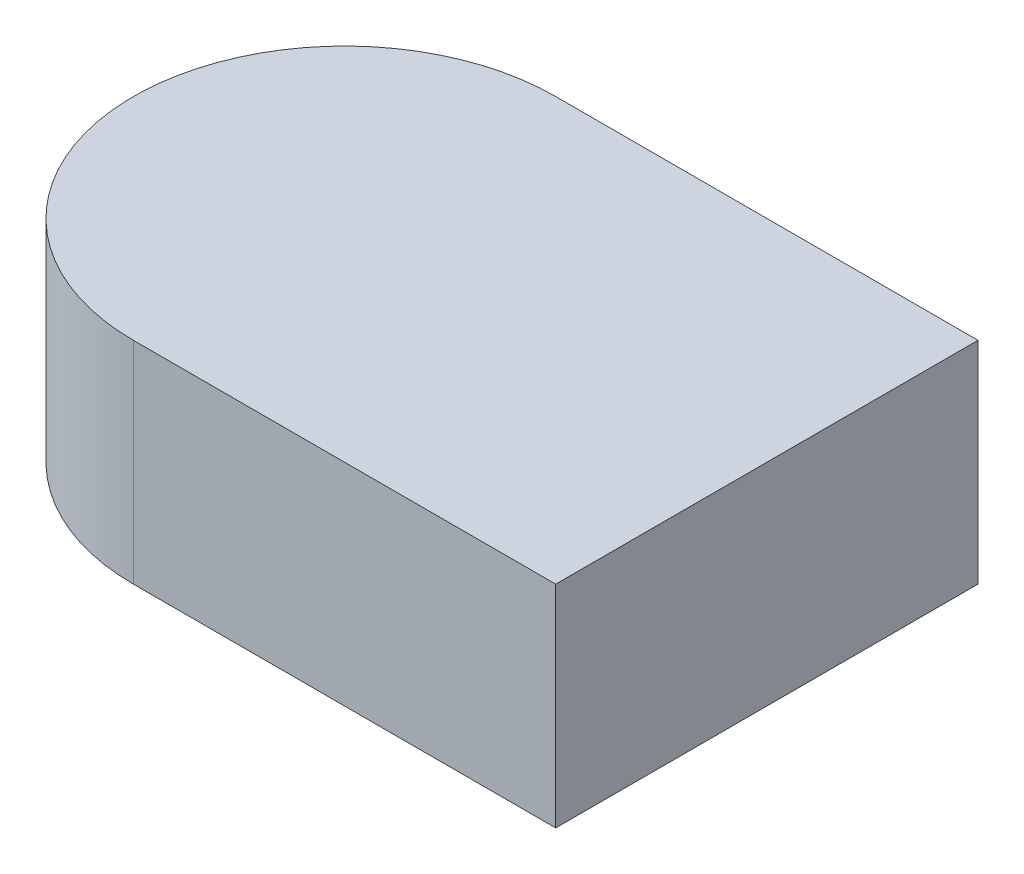
ISO-10303-21;
HEADER;
FILE_DESCRIPTION(('STEP AP214'),'2;1');
FILE_NAME('part.step','',(''),(''),'','','');
FILE_SCHEMA(('AUTOMOTIVE_DESIGN { 1 0 10303 214 1 1 1 1 }'));
ENDSEC;
DATA;
#1=APPLICATION_CONTEXT('core data for automotive mechanical design processes');
#2=APPLICATION_PROTOCOL_DEFINITION('international standard','automotive_design',2000,#1);
#3=PRODUCT_CONTEXT('',#1,'mechanical');
#4=PRODUCT('Part','Part','',(#3));
#5=PRODUCT_RELATED_PRODUCT_CATEGORY('part','',(#4));
#6=PRODUCT_DEFINITION_FORMATION('','',#4);
#7=PRODUCT_DEFINITION_CONTEXT('part definition',#1,'design');
#8=PRODUCT_DEFINITION('design','',#6,#7);
#9=PRODUCT_DEFINITION_SHAPE('','',#8);
#10=(LENGTH_UNIT() NAMED_UNIT(*) SI_UNIT(.MILLI.,.METRE.));
#11=(NAMED_UNIT(*) PLANE_ANGLE_UNIT() SI_UNIT($,.RADIAN.));
#12=(NAMED_UNIT(*) SI_UNIT($,.STERADIAN.) SOLID_ANGLE_UNIT());
#13=UNCERTAINTY_MEASURE_WITH_UNIT(LENGTH_MEASURE(1.E-05),#10,'distance_accuracy_value','');
#14=(GEOMETRIC_REPRESENTATION_CONTEXT(3) GLOBAL_UNCERTAINTY_ASSIGNED_CONTEXT((#13)) GLOBAL_UNIT_ASSIGNED_CONTEXT((#10,
#11,#12)) REPRESENTATION_CONTEXT('',''));
#15=CARTESIAN_POINT('',(0.,0.,0.));
#16=DIRECTION('',(0.,0.,1.));
#17=DIRECTION('',(1.,0.,0.));
#18=AXIS2_PLACEMENT_3D('',#15,#16,#17);
#19=CARTESIAN_POINT('',(0.,0.,0.));
#20=DIRECTION('',(0.,1.,0.));
#21=DIRECTION('',(1.,0.,0.));
#22=AXIS2_PLACEMENT_3D('',#19,#20,#21);
#23=PLANE('',#22);
#24=DIRECTION('',(0.,0.,-1.));
#25=VECTOR('',#24,1.);
#26=CARTESIAN_POINT('',(1.25,0.,0.3));
#27=LINE('',#26,#25);
#28=CARTESIAN_POINT('',(1.25,0.,0.3));
#29=VERTEX_POINT('',#28);
#30=CARTESIAN_POINT('',(1.25,0.,0.1));
#31=VERTEX_POINT('',#30);
#32=EDGE_CURVE('E11',#29,#31,#27,.T.);
#33=ORIENTED_EDGE('',*,*,#32,.F.);
#34=DIRECTION('',(1.,0.,0.));
#35=VECTOR('',#34,1.);
#36=CARTESIAN_POINT('',(1.05,0.,0.3));
#37=LINE('',#36,#35);
#38=CARTESIAN_POINT('',(1.05,0.,0.3));
#39=VERTEX_POINT('',#38);
#40=EDGE_CURVE('E25',#39,#29,#37,.T.);
#41=ORIENTED_EDGE('',*,*,#40,.F.);
#42=CARTESIAN_POINT('',(1.05,0.,0.2));
#43=DIRECTION('',(0.,1.,0.));
#44=DIRECTION('',(0.,0.,-1.));
#45=AXIS2_PLACEMENT_3D('',#42,#43,#44);
#46=CIRCLE('',#45,0.1);
#47=CARTESIAN_POINT('',(1.05,0.,0.1));
#48=VERTEX_POINT('',#47);
#49=EDGE_CURVE('E73',#48,#39,#46,.T.);
#50=ORIENTED_EDGE('',*,*,#49,.F.);
#51=DIRECTION('',(-1.,0.,0.));
#52=VECTOR('',#51,1.);
#53=CARTESIAN_POINT('',(1.25,0.,0.1));
#54=LINE('',#53,#52);
#55=EDGE_CURVE('E99',#31,#48,#54,.T.);
#56=ORIENTED_EDGE('',*,*,#55,.F.);
#57=EDGE_LOOP('',(#33,#41,#50,#56));
#58=FACE_BOUND('',#57,.T.);
#59=ADVANCED_FACE('F17',(#58),#23,.F.);
#60=CARTESIAN_POINT('',(1.25,0.,0.1));
#61=DIRECTION('',(0.,0.,-1.));
#62=DIRECTION('',(-1.,0.,0.));
#63=AXIS2_PLACEMENT_3D('',#60,#61,#62);
#64=PLANE('',#63);
#65=DIRECTION('',(0.,1.,0.));
#66=VECTOR('',#65,1.);
#67=CARTESIAN_POINT('',(1.05,0.,0.1));
#68=LINE('',#67,#66);
#69=CARTESIAN_POINT('',(1.05,0.1,0.1));
#70=VERTEX_POINT('',#69);
#71=EDGE_CURVE('E95',#48,#70,#68,.T.);
#72=ORIENTED_EDGE('',*,*,#71,.T.);
#73=DIRECTION('',(-1.,0.,0.));
#74=VECTOR('',#73,1.);
#75=CARTESIAN_POINT('',(1.25,0.1,0.1));
#76=LINE('',#75,#74);
#77=CARTESIAN_POINT('',(1.25,0.1,0.1));
#78=VERTEX_POINT('',#77);
#79=EDGE_CURVE('E68',#78,#70,#76,.T.);
#80=ORIENTED_EDGE('',*,*,#79,.F.);
#81=DIRECTION('',(0.,1.,0.));
#82=VECTOR('',#81,1.);
#83=CARTESIAN_POINT('',(1.25,0.,0.1));
#84=LINE('',#83,#82);
#85=EDGE_CURVE('E87',#31,#78,#84,.T.);
#86=ORIENTED_EDGE('',*,*,#85,.F.);
#87=ORIENTED_EDGE('',*,*,#55,.T.);
#88=EDGE_LOOP('',(#72,#80,#86,#87));
#89=FACE_BOUND('',#88,.T.);
#90=ADVANCED_FACE('F113',(#89),#64,.T.);
#91=CARTESIAN_POINT('',(1.25,0.,0.3));
#92=DIRECTION('',(1.,0.,0.));
#93=DIRECTION('',(0.,0.,-1.));
#94=AXIS2_PLACEMENT_3D('',#91,#92,#93);
#95=PLANE('',#94);
#96=ORIENTED_EDGE('',*,*,#85,.T.);
#97=DIRECTION('',(0.,0.,-1.));
#98=VECTOR('',#97,1.);
#99=CARTESIAN_POINT('',(1.25,0.1,0.3));
#100=LINE('',#99,#98);
#101=CARTESIAN_POINT('',(1.25,0.1,0.3));
#102=VERTEX_POINT('',#101);
#103=EDGE_CURVE('E83',#102,#78,#100,.T.);
#104=ORIENTED_EDGE('',*,*,#103,.F.);
#105=DIRECTION('',(0.,1.,0.));
#106=VECTOR('',#105,1.);
#107=CARTESIAN_POINT('',(1.25,0.,0.3));
#108=LINE('',#107,#106);
#109=EDGE_CURVE('E60',#29,#102,#108,.T.);
#110=ORIENTED_EDGE('',*,*,#109,.F.);
#111=ORIENTED_EDGE('',*,*,#32,.T.);
#112=EDGE_LOOP('',(#96,#104,#110,#111));
#113=FACE_BOUND('',#112,.T.);
#114=ADVANCED_FACE('F119',(#113),#95,.T.);
#115=CARTESIAN_POINT('',(1.05,0.,0.3));
#116=DIRECTION('',(0.,0.,1.));
#117=DIRECTION('',(1.,0.,0.));
#118=AXIS2_PLACEMENT_3D('',#115,#116,#117);
#119=PLANE('',#118);
#120=ORIENTED_EDGE('',*,*,#109,.T.);
#121=DIRECTION('',(1.,0.,0.));
#122=VECTOR('',#121,1.);
#123=CARTESIAN_POINT('',(1.05,0.1,0.3));
#124=LINE('',#123,#122);
#125=CARTESIAN_POINT('',(1.05,0.1,0.3));
#126=VERTEX_POINT('',#125);
#127=EDGE_CURVE('E54',#126,#102,#124,.T.);
#128=ORIENTED_EDGE('',*,*,#127,.F.);
#129=DIRECTION('',(0.,1.,0.));
#130=VECTOR('',#129,1.);
#131=CARTESIAN_POINT('',(1.05,0.,0.3));
#132=LINE('',#131,#130);
#133=EDGE_CURVE('E58',#39,#126,#132,.T.);
#134=ORIENTED_EDGE('',*,*,#133,.F.);
#135=ORIENTED_EDGE('',*,*,#40,.T.);
#136=EDGE_LOOP('',(#120,#128,#134,#135));
#137=FACE_BOUND('',#136,.T.);
#138=ADVANCED_FACE('F56',(#137),#119,.T.);
#139=CARTESIAN_POINT('',(1.05,0.,0.2));
#140=DIRECTION('',(0.,1.,0.));
#141=DIRECTION('',(1.,0.,0.));
#142=AXIS2_PLACEMENT_3D('',#139,#140,#141);
#143=CYLINDRICAL_SURFACE('',#142,0.1);
#144=ORIENTED_EDGE('',*,*,#133,.T.);
#145=CARTESIAN_POINT('',(1.05,0.1,0.2));
#146=DIRECTION('',(0.,1.,0.));
#147=DIRECTION('',(0.,0.,-1.));
#148=AXIS2_PLACEMENT_3D('',#145,#146,#147);
#149=CIRCLE('',#148,0.1);
#150=EDGE_CURVE('E66',#70,#126,#149,.T.);
#151=ORIENTED_EDGE('',*,*,#150,.F.);
#152=ORIENTED_EDGE('',*,*,#71,.F.);
#153=ORIENTED_EDGE('',*,*,#49,.T.);
#154=EDGE_LOOP('',(#144,#151,#152,#153));
#155=FACE_BOUND('',#154,.T.);
#156=ADVANCED_FACE('F72',(#155),#143,.T.);
#157=CARTESIAN_POINT('',(0.,0.1,0.));
#158=DIRECTION('',(0.,1.,0.));
#159=DIRECTION('',(1.,0.,0.));
#160=AXIS2_PLACEMENT_3D('',#157,#158,#159);
#161=PLANE('',#160);
#162=ORIENTED_EDGE('',*,*,#150,.T.);
#163=ORIENTED_EDGE('',*,*,#127,.T.);
#164=ORIENTED_EDGE('',*,*,#103,.T.);
#165=ORIENTED_EDGE('',*,*,#79,.T.);
#166=EDGE_LOOP('',(#162,#163,#164,#165));
#167=FACE_BOUND('',#166,.T.);
#168=ADVANCED_FACE('F67',(#167),#161,.T.);
#169=CLOSED_SHELL('',(#59,#90,#114,#138,#156,#168));
#170=MANIFOLD_SOLID_BREP('B1',#169);
#171=ADVANCED_BREP_SHAPE_REPRESENTATION('',(#18,#170),#14);
#172=SHAPE_DEFINITION_REPRESENTATION(#9,#171);
ENDSEC;
END-ISO-10303-21;
